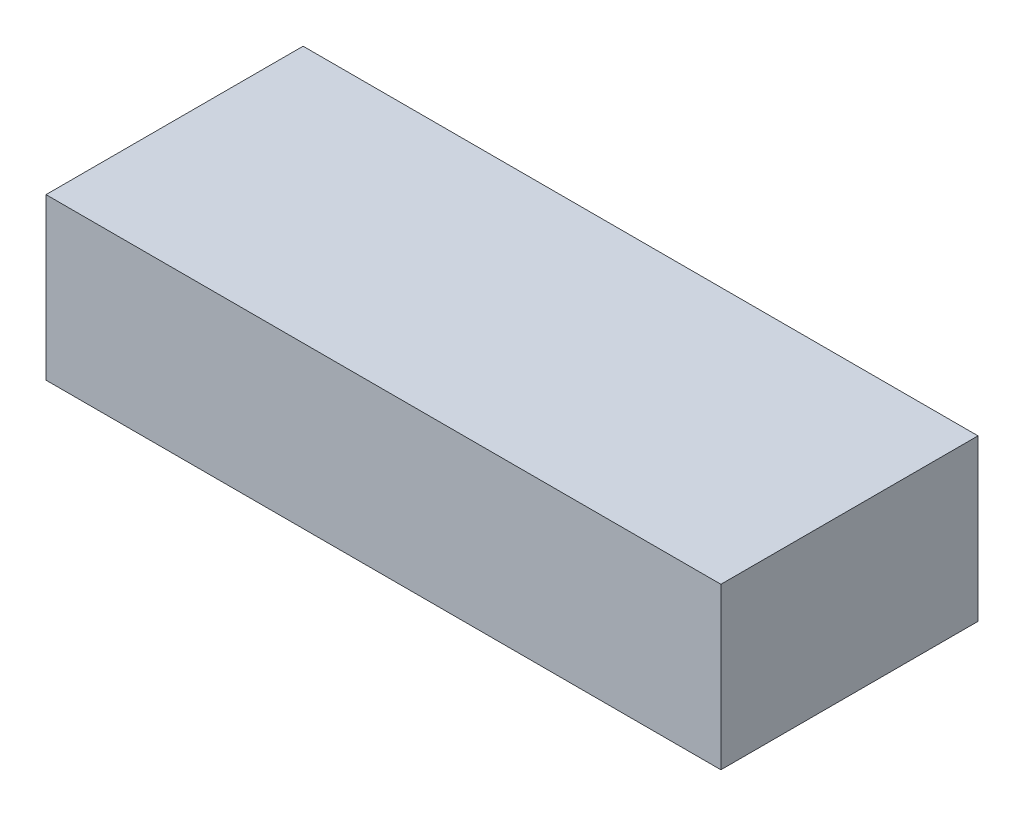
ISO-10303-21;
HEADER;
FILE_DESCRIPTION(('STEP AP214'),'2;1');
FILE_NAME('part.step','',(''),(''),'','','');
FILE_SCHEMA(('AUTOMOTIVE_DESIGN { 1 0 10303 214 1 1 1 1 }'));
ENDSEC;
DATA;
#1=APPLICATION_CONTEXT('core data for automotive mechanical design processes');
#2=APPLICATION_PROTOCOL_DEFINITION('international standard','automotive_design',2000,#1);
#3=PRODUCT_CONTEXT('',#1,'mechanical');
#4=PRODUCT('Part','Part','',(#3));
#5=PRODUCT_RELATED_PRODUCT_CATEGORY('part','',(#4));
#6=PRODUCT_DEFINITION_FORMATION('','',#4);
#7=PRODUCT_DEFINITION_CONTEXT('part definition',#1,'design');
#8=PRODUCT_DEFINITION('design','',#6,#7);
#9=PRODUCT_DEFINITION_SHAPE('','',#8);
#10=(LENGTH_UNIT() NAMED_UNIT(*) SI_UNIT(.MILLI.,.METRE.));
#11=(NAMED_UNIT(*) PLANE_ANGLE_UNIT() SI_UNIT($,.RADIAN.));
#12=(NAMED_UNIT(*) SI_UNIT($,.STERADIAN.) SOLID_ANGLE_UNIT());
#13=UNCERTAINTY_MEASURE_WITH_UNIT(LENGTH_MEASURE(1.E-05),#10,'distance_accuracy_value','');
#14=(GEOMETRIC_REPRESENTATION_CONTEXT(3) GLOBAL_UNCERTAINTY_ASSIGNED_CONTEXT((#13)) GLOBAL_UNIT_ASSIGNED_CONTEXT((#10,
#11,#12)) REPRESENTATION_CONTEXT('',''));
#15=CARTESIAN_POINT('',(0.,0.,0.));
#16=DIRECTION('',(0.,0.,1.));
#17=DIRECTION('',(1.,0.,0.));
#18=AXIS2_PLACEMENT_3D('',#15,#16,#17);
#19=CARTESIAN_POINT('',(0.,15.875,0.));
#20=DIRECTION('',(1.,0.,0.));
#21=DIRECTION('',(0.,0.,-1.));
#22=AXIS2_PLACEMENT_3D('',#19,#20,#21);
#23=PLANE('',#22);
#24=DIRECTION('',(0.,0.,1.));
#25=VECTOR('',#24,1.);
#26=CARTESIAN_POINT('',(0.,0.,0.));
#27=LINE('',#26,#25);
#28=CARTESIAN_POINT('',(0.,0.,-25.4));
#29=VERTEX_POINT('',#28);
#30=CARTESIAN_POINT('',(0.,0.,0.));
#31=VERTEX_POINT('',#30);
#32=EDGE_CURVE('E96',#29,#31,#27,.T.);
#33=ORIENTED_EDGE('',*,*,#32,.T.);
#34=DIRECTION('',(0.,-1.,0.));
#35=VECTOR('',#34,1.);
#36=CARTESIAN_POINT('',(0.,15.875,0.));
#37=LINE('',#36,#35);
#38=CARTESIAN_POINT('',(0.,15.875,0.));
#39=VERTEX_POINT('',#38);
#40=EDGE_CURVE('E11',#39,#31,#37,.T.);
#41=ORIENTED_EDGE('',*,*,#40,.F.);
#42=DIRECTION('',(0.,0.,1.));
#43=VECTOR('',#42,1.);
#44=CARTESIAN_POINT('',(0.,15.875,0.));
#45=LINE('',#44,#43);
#46=CARTESIAN_POINT('',(0.,15.875,-25.4));
#47=VERTEX_POINT('',#46);
#48=EDGE_CURVE('E84',#47,#39,#45,.T.);
#49=ORIENTED_EDGE('',*,*,#48,.F.);
#50=DIRECTION('',(0.,-1.,0.));
#51=VECTOR('',#50,1.);
#52=CARTESIAN_POINT('',(0.,15.875,-25.4));
#53=LINE('',#52,#51);
#54=EDGE_CURVE('E92',#47,#29,#53,.T.);
#55=ORIENTED_EDGE('',*,*,#54,.T.);
#56=EDGE_LOOP('',(#33,#41,#49,#55));
#57=FACE_BOUND('',#56,.T.);
#58=ADVANCED_FACE('F33',(#57),#23,.F.);
#59=CARTESIAN_POINT('',(0.,15.875,0.));
#60=DIRECTION('',(0.,0.,-1.));
#61=DIRECTION('',(-1.,0.,0.));
#62=AXIS2_PLACEMENT_3D('',#59,#60,#61);
#63=PLANE('',#62);
#64=DIRECTION('',(1.,0.,0.));
#65=VECTOR('',#64,1.);
#66=CARTESIAN_POINT('',(0.,0.,0.));
#67=LINE('',#66,#65);
#68=CARTESIAN_POINT('',(66.675,0.,0.));
#69=VERTEX_POINT('',#68);
#70=EDGE_CURVE('E88',#31,#69,#67,.T.);
#71=ORIENTED_EDGE('',*,*,#70,.T.);
#72=DIRECTION('',(0.,-1.,0.));
#73=VECTOR('',#72,1.);
#74=CARTESIAN_POINT('',(66.675,15.875,0.));
#75=LINE('',#74,#73);
#76=CARTESIAN_POINT('',(66.675,15.875,0.));
#77=VERTEX_POINT('',#76);
#78=EDGE_CURVE('E41',#77,#69,#75,.T.);
#79=ORIENTED_EDGE('',*,*,#78,.F.);
#80=DIRECTION('',(1.,0.,0.));
#81=VECTOR('',#80,1.);
#82=CARTESIAN_POINT('',(0.,15.875,0.));
#83=LINE('',#82,#81);
#84=EDGE_CURVE('E79',#39,#77,#83,.T.);
#85=ORIENTED_EDGE('',*,*,#84,.F.);
#86=ORIENTED_EDGE('',*,*,#40,.T.);
#87=EDGE_LOOP('',(#71,#79,#85,#86));
#88=FACE_BOUND('',#87,.T.);
#89=ADVANCED_FACE('F87',(#88),#63,.F.);
#90=CARTESIAN_POINT('',(66.675,15.875,0.));
#91=DIRECTION('',(-1.,0.,0.));
#92=DIRECTION('',(0.,0.,1.));
#93=AXIS2_PLACEMENT_3D('',#90,#91,#92);
#94=PLANE('',#93);
#95=DIRECTION('',(0.,0.,-1.));
#96=VECTOR('',#95,1.);
#97=CARTESIAN_POINT('',(66.675,0.,0.));
#98=LINE('',#97,#96);
#99=CARTESIAN_POINT('',(66.675,0.,-25.4));
#100=VERTEX_POINT('',#99);
#101=EDGE_CURVE('E66',#69,#100,#98,.T.);
#102=ORIENTED_EDGE('',*,*,#101,.T.);
#103=DIRECTION('',(0.,-1.,0.));
#104=VECTOR('',#103,1.);
#105=CARTESIAN_POINT('',(66.675,15.875,-25.4));
#106=LINE('',#105,#104);
#107=CARTESIAN_POINT('',(66.675,15.875,-25.4));
#108=VERTEX_POINT('',#107);
#109=EDGE_CURVE('E89',#108,#100,#106,.T.);
#110=ORIENTED_EDGE('',*,*,#109,.F.);
#111=DIRECTION('',(0.,0.,-1.));
#112=VECTOR('',#111,1.);
#113=CARTESIAN_POINT('',(66.675,15.875,0.));
#114=LINE('',#113,#112);
#115=EDGE_CURVE('E82',#77,#108,#114,.T.);
#116=ORIENTED_EDGE('',*,*,#115,.F.);
#117=ORIENTED_EDGE('',*,*,#78,.T.);
#118=EDGE_LOOP('',(#102,#110,#116,#117));
#119=FACE_BOUND('',#118,.T.);
#120=ADVANCED_FACE('F90',(#119),#94,.F.);
#121=CARTESIAN_POINT('',(0.,15.875,-25.4));
#122=DIRECTION('',(0.,0.,1.));
#123=DIRECTION('',(1.,0.,0.));
#124=AXIS2_PLACEMENT_3D('',#121,#122,#123);
#125=PLANE('',#124);
#126=DIRECTION('',(-1.,0.,0.));
#127=VECTOR('',#126,1.);
#128=CARTESIAN_POINT('',(0.,0.,-25.4));
#129=LINE('',#128,#127);
#130=EDGE_CURVE('E72',#100,#29,#129,.T.);
#131=ORIENTED_EDGE('',*,*,#130,.T.);
#132=ORIENTED_EDGE('',*,*,#54,.F.);
#133=DIRECTION('',(-1.,0.,0.));
#134=VECTOR('',#133,1.);
#135=CARTESIAN_POINT('',(0.,15.875,-25.4));
#136=LINE('',#135,#134);
#137=EDGE_CURVE('E49',#108,#47,#136,.T.);
#138=ORIENTED_EDGE('',*,*,#137,.F.);
#139=ORIENTED_EDGE('',*,*,#109,.T.);
#140=EDGE_LOOP('',(#131,#132,#138,#139));
#141=FACE_BOUND('',#140,.T.);
#142=ADVANCED_FACE('F103',(#141),#125,.F.);
#143=CARTESIAN_POINT('',(0.,15.875,0.));
#144=DIRECTION('',(0.,-1.,0.));
#145=DIRECTION('',(0.,0.,-1.));
#146=AXIS2_PLACEMENT_3D('',#143,#144,#145);
#147=PLANE('',#146);
#148=ORIENTED_EDGE('',*,*,#48,.T.);
#149=ORIENTED_EDGE('',*,*,#84,.T.);
#150=ORIENTED_EDGE('',*,*,#115,.T.);
#151=ORIENTED_EDGE('',*,*,#137,.T.);
#152=EDGE_LOOP('',(#148,#149,#150,#151));
#153=FACE_BOUND('',#152,.T.);
#154=ADVANCED_FACE('F80',(#153),#147,.F.);
#155=CARTESIAN_POINT('',(0.,0.,0.));
#156=DIRECTION('',(0.,-1.,0.));
#157=DIRECTION('',(0.,0.,-1.));
#158=AXIS2_PLACEMENT_3D('',#155,#156,#157);
#159=PLANE('',#158);
#160=ORIENTED_EDGE('',*,*,#32,.F.);
#161=ORIENTED_EDGE('',*,*,#130,.F.);
#162=ORIENTED_EDGE('',*,*,#101,.F.);
#163=ORIENTED_EDGE('',*,*,#70,.F.);
#164=EDGE_LOOP('',(#160,#161,#162,#163));
#165=FACE_BOUND('',#164,.T.);
#166=ADVANCED_FACE('F106',(#165),#159,.T.);
#167=CLOSED_SHELL('',(#58,#89,#120,#142,#154,#166));
#168=MANIFOLD_SOLID_BREP('B2',#167);
#169=ADVANCED_BREP_SHAPE_REPRESENTATION('',(#18,#168),#14);
#170=SHAPE_DEFINITION_REPRESENTATION(#9,#169);
ENDSEC;
END-ISO-10303-21;
